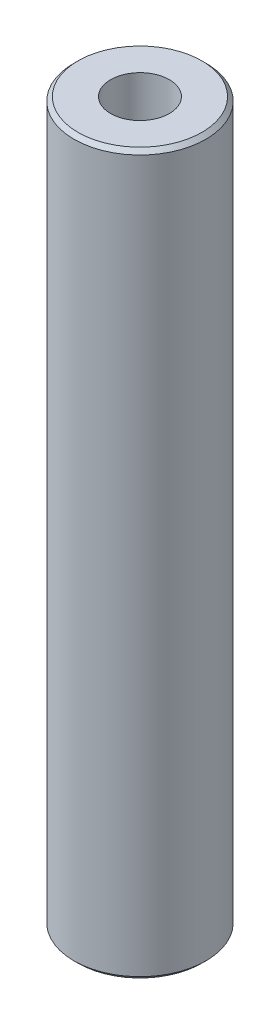
ISO-10303-21;
HEADER;
FILE_DESCRIPTION(('STEP AP214'),'2;1');
FILE_NAME('part.step','',(''),(''),'','','');
FILE_SCHEMA(('AUTOMOTIVE_DESIGN { 1 0 10303 214 1 1 1 1 }'));
ENDSEC;
DATA;
#1=APPLICATION_CONTEXT('core data for automotive mechanical design processes');
#2=APPLICATION_PROTOCOL_DEFINITION('international standard','automotive_design',2000,#1);
#3=PRODUCT_CONTEXT('',#1,'mechanical');
#4=PRODUCT('Part','Part','',(#3));
#5=PRODUCT_RELATED_PRODUCT_CATEGORY('part','',(#4));
#6=PRODUCT_DEFINITION_FORMATION('','',#4);
#7=PRODUCT_DEFINITION_CONTEXT('part definition',#1,'design');
#8=PRODUCT_DEFINITION('design','',#6,#7);
#9=PRODUCT_DEFINITION_SHAPE('','',#8);
#10=(LENGTH_UNIT() NAMED_UNIT(*) SI_UNIT(.MILLI.,.METRE.));
#11=(NAMED_UNIT(*) PLANE_ANGLE_UNIT() SI_UNIT($,.RADIAN.));
#12=(NAMED_UNIT(*) SI_UNIT($,.STERADIAN.) SOLID_ANGLE_UNIT());
#13=UNCERTAINTY_MEASURE_WITH_UNIT(LENGTH_MEASURE(1.E-05),#10,'distance_accuracy_value','');
#14=(GEOMETRIC_REPRESENTATION_CONTEXT(3) GLOBAL_UNCERTAINTY_ASSIGNED_CONTEXT((#13)) GLOBAL_UNIT_ASSIGNED_CONTEXT((#10,
#11,#12)) REPRESENTATION_CONTEXT('',''));
#15=CARTESIAN_POINT('',(0.,0.,0.));
#16=DIRECTION('',(0.,0.,1.));
#17=DIRECTION('',(1.,0.,0.));
#18=AXIS2_PLACEMENT_3D('',#15,#16,#17);
#19=CARTESIAN_POINT('',(0.,600.,0.));
#20=DIRECTION('',(0.,-1.,0.));
#21=DIRECTION('',(0.,0.,-1.));
#22=AXIS2_PLACEMENT_3D('',#19,#20,#21);
#23=CYLINDRICAL_SURFACE('',#22,55.);
#24=CARTESIAN_POINT('',(0.,596.6785971426,0.));
#25=DIRECTION('',(0.,1.,0.));
#26=DIRECTION('',(0.,0.,1.));
#27=AXIS2_PLACEMENT_3D('',#24,#25,#26);
#28=CIRCLE('',#27,55.);
#29=CARTESIAN_POINT('',(0.,596.6785971426,55.));
#30=VERTEX_POINT('',#29);
#31=EDGE_CURVE('E50',#30,#30,#28,.F.);
#32=ORIENTED_EDGE('',*,*,#31,.T.);
#33=EDGE_LOOP('',(#32));
#34=FACE_BOUND('',#33,.T.);
#35=CARTESIAN_POINT('',(0.,3.3214028573999,0.));
#36=DIRECTION('',(0.,1.,0.));
#37=DIRECTION('',(0.,0.,1.));
#38=AXIS2_PLACEMENT_3D('',#35,#36,#37);
#39=CIRCLE('',#38,55.);
#40=CARTESIAN_POINT('',(0.,3.3214028573999,55.));
#41=VERTEX_POINT('',#40);
#42=EDGE_CURVE('E51',#41,#41,#39,.T.);
#43=ORIENTED_EDGE('',*,*,#42,.T.);
#44=EDGE_LOOP('',(#43));
#45=FACE_BOUND('',#44,.T.);
#46=ADVANCED_FACE('F39',(#34,#45),#23,.T.);
#47=CARTESIAN_POINT('',(0.,600.,0.));
#48=DIRECTION('',(0.,1.,0.));
#49=DIRECTION('',(0.,0.,1.));
#50=AXIS2_PLACEMENT_3D('',#47,#48,#49);
#51=PLANE('',#50);
#52=CARTESIAN_POINT('',(0.,600.,0.));
#53=DIRECTION('',(0.,1.,0.));
#54=DIRECTION('',(0.,0.,1.));
#55=AXIS2_PLACEMENT_3D('',#52,#53,#54);
#56=CIRCLE('',#55,51.6785971426001);
#57=CARTESIAN_POINT('',(0.,600.,51.6785971426001));
#58=VERTEX_POINT('',#57);
#59=EDGE_CURVE('E54',#58,#58,#56,.T.);
#60=ORIENTED_EDGE('',*,*,#59,.T.);
#61=EDGE_LOOP('',(#60));
#62=FACE_BOUND('',#61,.T.);
#63=CARTESIAN_POINT('',(0.,600.,0.));
#64=DIRECTION('',(0.,1.,0.));
#65=DIRECTION('',(0.,0.,1.));
#66=AXIS2_PLACEMENT_3D('',#63,#64,#65);
#67=CIRCLE('',#66,24.4886202051193);
#68=CARTESIAN_POINT('',(0.,600.,24.4886202051193));
#69=VERTEX_POINT('',#68);
#70=EDGE_CURVE('E58',#69,#69,#67,.T.);
#71=ORIENTED_EDGE('',*,*,#70,.F.);
#72=EDGE_LOOP('',(#71));
#73=FACE_BOUND('',#72,.T.);
#74=ADVANCED_FACE('F69',(#62,#73),#51,.T.);
#75=CARTESIAN_POINT('',(0.,0.,0.));
#76=DIRECTION('',(0.,1.,0.));
#77=DIRECTION('',(0.,0.,1.));
#78=AXIS2_PLACEMENT_3D('',#75,#76,#77);
#79=PLANE('',#78);
#80=CARTESIAN_POINT('',(0.,0.,0.));
#81=DIRECTION('',(0.,1.,0.));
#82=DIRECTION('',(0.,0.,1.));
#83=AXIS2_PLACEMENT_3D('',#80,#81,#82);
#84=CIRCLE('',#83,51.6785971426);
#85=CARTESIAN_POINT('',(0.,0.,51.6785971426));
#86=VERTEX_POINT('',#85);
#87=EDGE_CURVE('E10',#86,#86,#84,.F.);
#88=ORIENTED_EDGE('',*,*,#87,.T.);
#89=EDGE_LOOP('',(#88));
#90=FACE_BOUND('',#89,.T.);
#91=CARTESIAN_POINT('',(0.,0.,0.));
#92=DIRECTION('',(0.,1.,0.));
#93=DIRECTION('',(0.,0.,1.));
#94=AXIS2_PLACEMENT_3D('',#91,#92,#93);
#95=CIRCLE('',#94,24.4886202051193);
#96=CARTESIAN_POINT('',(0.,0.,24.4886202051193));
#97=VERTEX_POINT('',#96);
#98=EDGE_CURVE('E63',#97,#97,#95,.T.);
#99=ORIENTED_EDGE('',*,*,#98,.T.);
#100=EDGE_LOOP('',(#99));
#101=FACE_BOUND('',#100,.T.);
#102=ADVANCED_FACE('F75',(#90,#101),#79,.F.);
#103=CARTESIAN_POINT('',(0.,600.,0.));
#104=DIRECTION('',(0.,-1.,0.));
#105=DIRECTION('',(0.,0.,-1.));
#106=AXIS2_PLACEMENT_3D('',#103,#104,#105);
#107=CYLINDRICAL_SURFACE('',#106,24.4886202051193);
#108=ORIENTED_EDGE('',*,*,#70,.T.);
#109=EDGE_LOOP('',(#108));
#110=FACE_BOUND('',#109,.T.);
#111=ORIENTED_EDGE('',*,*,#98,.F.);
#112=EDGE_LOOP('',(#111));
#113=FACE_BOUND('',#112,.T.);
#114=ADVANCED_FACE('F70',(#110,#113),#107,.F.);
#115=CARTESIAN_POINT('',(0.,600.,0.));
#116=DIRECTION('',(0.,-1.,0.));
#117=DIRECTION('',(0.,0.,-1.));
#118=AXIS2_PLACEMENT_3D('',#115,#116,#117);
#119=CONICAL_SURFACE('',#118,51.6785971426001,0.785398163397416);
#120=ORIENTED_EDGE('',*,*,#31,.F.);
#121=EDGE_LOOP('',(#120));
#122=FACE_BOUND('',#121,.T.);
#123=ORIENTED_EDGE('',*,*,#59,.F.);
#124=EDGE_LOOP('',(#123));
#125=FACE_BOUND('',#124,.T.);
#126=ADVANCED_FACE('F81',(#122,#125),#119,.T.);
#127=CARTESIAN_POINT('',(0.,3.3214028573999,0.));
#128=DIRECTION('',(0.,1.,0.));
#129=DIRECTION('',(0.,0.,1.));
#130=AXIS2_PLACEMENT_3D('',#127,#128,#129);
#131=CONICAL_SURFACE('',#130,55.,0.785398163397458);
#132=ORIENTED_EDGE('',*,*,#87,.F.);
#133=EDGE_LOOP('',(#132));
#134=FACE_BOUND('',#133,.T.);
#135=ORIENTED_EDGE('',*,*,#42,.F.);
#136=EDGE_LOOP('',(#135));
#137=FACE_BOUND('',#136,.T.);
#138=ADVANCED_FACE('F45',(#134,#137),#131,.T.);
#139=CLOSED_SHELL('',(#46,#74,#102,#114,#126,#138));
#140=MANIFOLD_SOLID_BREP('B2',#139);
#141=ADVANCED_BREP_SHAPE_REPRESENTATION('',(#18,#140),#14);
#142=SHAPE_DEFINITION_REPRESENTATION(#9,#141);
ENDSEC;
END-ISO-10303-21;
